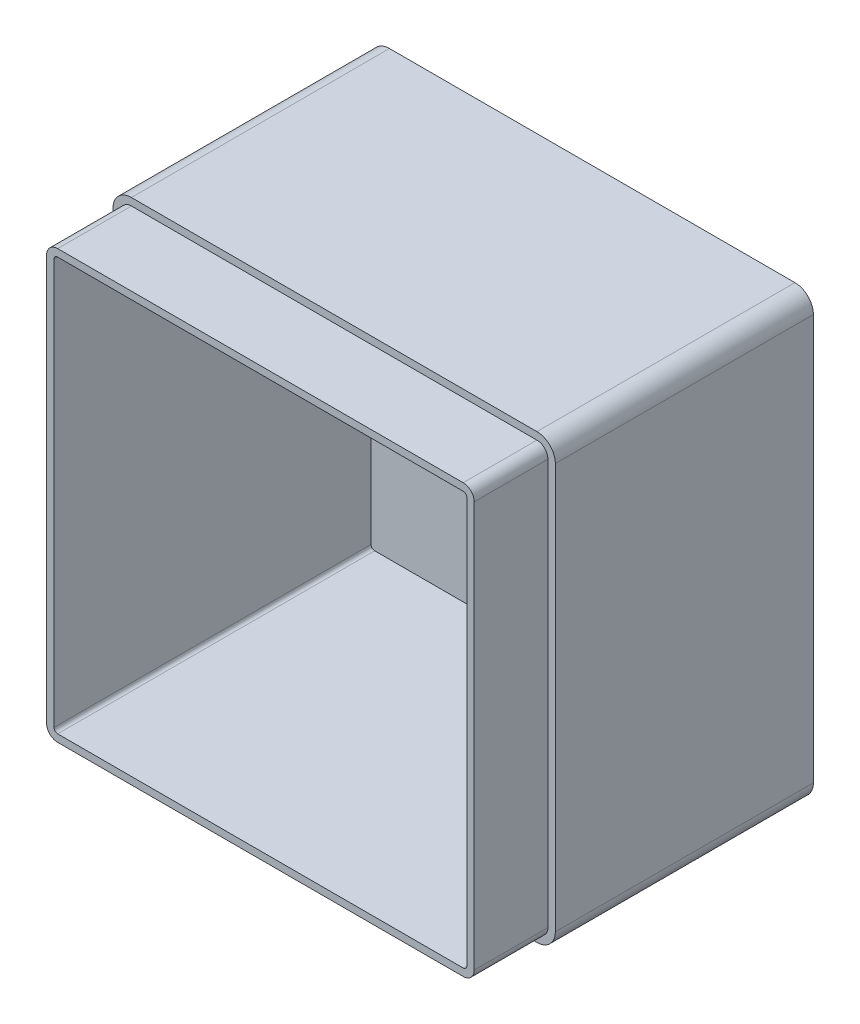
ISO-10303-21;
HEADER;
FILE_DESCRIPTION(('STEP AP214'),'2;1');
FILE_NAME('part.step','',(''),(''),'','','');
FILE_SCHEMA(('AUTOMOTIVE_DESIGN { 1 0 10303 214 1 1 1 1 }'));
ENDSEC;
DATA;
#1=APPLICATION_CONTEXT('core data for automotive mechanical design processes');
#2=APPLICATION_PROTOCOL_DEFINITION('international standard','automotive_design',2000,#1);
#3=PRODUCT_CONTEXT('',#1,'mechanical');
#4=PRODUCT('Part','Part','',(#3));
#5=PRODUCT_RELATED_PRODUCT_CATEGORY('part','',(#4));
#6=PRODUCT_DEFINITION_FORMATION('','',#4);
#7=PRODUCT_DEFINITION_CONTEXT('part definition',#1,'design');
#8=PRODUCT_DEFINITION('design','',#6,#7);
#9=PRODUCT_DEFINITION_SHAPE('','',#8);
#10=(LENGTH_UNIT() NAMED_UNIT(*) SI_UNIT(.MILLI.,.METRE.));
#11=(NAMED_UNIT(*) PLANE_ANGLE_UNIT() SI_UNIT($,.RADIAN.));
#12=(NAMED_UNIT(*) SI_UNIT($,.STERADIAN.) SOLID_ANGLE_UNIT());
#13=UNCERTAINTY_MEASURE_WITH_UNIT(LENGTH_MEASURE(1.E-05),#10,'distance_accuracy_value','');
#14=(GEOMETRIC_REPRESENTATION_CONTEXT(3) GLOBAL_UNCERTAINTY_ASSIGNED_CONTEXT((#13)) GLOBAL_UNIT_ASSIGNED_CONTEXT((#10,
#11,#12)) REPRESENTATION_CONTEXT('',''));
#15=CARTESIAN_POINT('',(0.,0.,0.));
#16=DIRECTION('',(0.,0.,1.));
#17=DIRECTION('',(1.,0.,0.));
#18=AXIS2_PLACEMENT_3D('',#15,#16,#17);
#19=CARTESIAN_POINT('',(0.,0.,90.));
#20=DIRECTION('',(0.,0.,1.));
#21=DIRECTION('',(1.,0.,0.));
#22=AXIS2_PLACEMENT_3D('',#19,#20,#21);
#23=PLANE('',#22);
#24=DIRECTION('',(0.,-1.,0.));
#25=VECTOR('',#24,1.);
#26=CARTESIAN_POINT('',(4.,0.,90.));
#27=LINE('',#26,#25);
#28=CARTESIAN_POINT('',(4.,-4.99999999999999,90.));
#29=VERTEX_POINT('',#28);
#30=CARTESIAN_POINT('',(4.,-115.,90.));
#31=VERTEX_POINT('',#30);
#32=EDGE_CURVE('E349',#29,#31,#27,.T.);
#33=ORIENTED_EDGE('',*,*,#32,.F.);
#34=CARTESIAN_POINT('',(5.,-5.,90.));
#35=DIRECTION('',(0.,0.,1.));
#36=DIRECTION('',(1.,0.,0.));
#37=AXIS2_PLACEMENT_3D('',#34,#35,#36);
#38=CIRCLE('',#37,1.);
#39=CARTESIAN_POINT('',(5.,-4.,90.));
#40=VERTEX_POINT('',#39);
#41=EDGE_CURVE('E389',#40,#29,#38,.T.);
#42=ORIENTED_EDGE('',*,*,#41,.F.);
#43=DIRECTION('',(-1.,0.,0.));
#44=VECTOR('',#43,1.);
#45=CARTESIAN_POINT('',(0.,-4.,90.));
#46=LINE('',#45,#44);
#47=CARTESIAN_POINT('',(115.,-4.,90.));
#48=VERTEX_POINT('',#47);
#49=EDGE_CURVE('E365',#48,#40,#46,.T.);
#50=ORIENTED_EDGE('',*,*,#49,.F.);
#51=CARTESIAN_POINT('',(115.,-5.,90.));
#52=DIRECTION('',(0.,0.,1.));
#53=DIRECTION('',(1.,0.,0.));
#54=AXIS2_PLACEMENT_3D('',#51,#52,#53);
#55=CIRCLE('',#54,1.);
#56=CARTESIAN_POINT('',(116.,-5.,90.));
#57=VERTEX_POINT('',#56);
#58=EDGE_CURVE('E396',#57,#48,#55,.T.);
#59=ORIENTED_EDGE('',*,*,#58,.F.);
#60=DIRECTION('',(0.,1.,0.));
#61=VECTOR('',#60,1.);
#62=CARTESIAN_POINT('',(116.,0.,90.));
#63=LINE('',#62,#61);
#64=CARTESIAN_POINT('',(116.,-115.,90.));
#65=VERTEX_POINT('',#64);
#66=EDGE_CURVE('E393',#65,#57,#63,.T.);
#67=ORIENTED_EDGE('',*,*,#66,.F.);
#68=CARTESIAN_POINT('',(115.,-115.,90.));
#69=DIRECTION('',(0.,0.,1.));
#70=DIRECTION('',(1.,0.,0.));
#71=AXIS2_PLACEMENT_3D('',#68,#69,#70);
#72=CIRCLE('',#71,1.);
#73=CARTESIAN_POINT('',(115.,-116.,90.));
#74=VERTEX_POINT('',#73);
#75=EDGE_CURVE('E329',#74,#65,#72,.T.);
#76=ORIENTED_EDGE('',*,*,#75,.F.);
#77=DIRECTION('',(1.,0.,0.));
#78=VECTOR('',#77,1.);
#79=CARTESIAN_POINT('',(0.,-116.,90.));
#80=LINE('',#79,#78);
#81=CARTESIAN_POINT('',(5.,-116.,90.));
#82=VERTEX_POINT('',#81);
#83=EDGE_CURVE('E386',#82,#74,#80,.T.);
#84=ORIENTED_EDGE('',*,*,#83,.F.);
#85=CARTESIAN_POINT('',(5.,-115.,90.));
#86=DIRECTION('',(0.,0.,1.));
#87=DIRECTION('',(1.,0.,0.));
#88=AXIS2_PLACEMENT_3D('',#85,#86,#87);
#89=CIRCLE('',#88,1.);
#90=EDGE_CURVE('E379',#31,#82,#89,.T.);
#91=ORIENTED_EDGE('',*,*,#90,.F.);
#92=EDGE_LOOP('',(#33,#42,#50,#59,#67,#76,#84,#91));
#93=FACE_BOUND('',#92,.T.);
#94=DIRECTION('',(-1.,0.,0.));
#95=VECTOR('',#94,1.);
#96=CARTESIAN_POINT('',(115.,-2.,90.));
#97=LINE('',#96,#95);
#98=CARTESIAN_POINT('',(115.,-1.99999999999997,90.));
#99=VERTEX_POINT('',#98);
#100=CARTESIAN_POINT('',(5.,-2.00000000000002,90.));
#101=VERTEX_POINT('',#100);
#102=EDGE_CURVE('E230',#99,#101,#97,.T.);
#103=ORIENTED_EDGE('',*,*,#102,.T.);
#104=CARTESIAN_POINT('',(5.,-5.,90.));
#105=DIRECTION('',(0.,0.,1.));
#106=DIRECTION('',(1.,0.,0.));
#107=AXIS2_PLACEMENT_3D('',#104,#105,#106);
#108=CIRCLE('',#107,2.99999999999999);
#109=CARTESIAN_POINT('',(2.,-5.,90.));
#110=VERTEX_POINT('',#109);
#111=EDGE_CURVE('E257',#101,#110,#108,.T.);
#112=ORIENTED_EDGE('',*,*,#111,.T.);
#113=DIRECTION('',(0.,-1.,0.));
#114=VECTOR('',#113,1.);
#115=CARTESIAN_POINT('',(2.,-5.,90.));
#116=LINE('',#115,#114);
#117=CARTESIAN_POINT('',(2.00000000000001,-115.,90.));
#118=VERTEX_POINT('',#117);
#119=EDGE_CURVE('E207',#110,#118,#116,.T.);
#120=ORIENTED_EDGE('',*,*,#119,.T.);
#121=CARTESIAN_POINT('',(5.,-115.,90.));
#122=DIRECTION('',(0.,0.,1.));
#123=DIRECTION('',(1.,0.,0.));
#124=AXIS2_PLACEMENT_3D('',#121,#122,#123);
#125=CIRCLE('',#124,2.99999999999999);
#126=CARTESIAN_POINT('',(5.,-118.,90.));
#127=VERTEX_POINT('',#126);
#128=EDGE_CURVE('E55',#118,#127,#125,.T.);
#129=ORIENTED_EDGE('',*,*,#128,.T.);
#130=DIRECTION('',(1.,0.,0.));
#131=VECTOR('',#130,1.);
#132=CARTESIAN_POINT('',(5.,-118.,90.));
#133=LINE('',#132,#131);
#134=CARTESIAN_POINT('',(115.,-118.,90.));
#135=VERTEX_POINT('',#134);
#136=EDGE_CURVE('E264',#127,#135,#133,.T.);
#137=ORIENTED_EDGE('',*,*,#136,.T.);
#138=CARTESIAN_POINT('',(115.,-115.,90.));
#139=DIRECTION('',(0.,0.,1.));
#140=DIRECTION('',(1.,0.,0.));
#141=AXIS2_PLACEMENT_3D('',#138,#139,#140);
#142=CIRCLE('',#141,3.);
#143=CARTESIAN_POINT('',(118.,-115.,90.));
#144=VERTEX_POINT('',#143);
#145=EDGE_CURVE('E268',#135,#144,#142,.T.);
#146=ORIENTED_EDGE('',*,*,#145,.T.);
#147=DIRECTION('',(0.,1.,0.));
#148=VECTOR('',#147,1.);
#149=CARTESIAN_POINT('',(118.,-115.,90.));
#150=LINE('',#149,#148);
#151=CARTESIAN_POINT('',(118.,-4.99999999999999,90.));
#152=VERTEX_POINT('',#151);
#153=EDGE_CURVE('E272',#144,#152,#150,.T.);
#154=ORIENTED_EDGE('',*,*,#153,.T.);
#155=CARTESIAN_POINT('',(115.,-5.,90.));
#156=DIRECTION('',(0.,0.,1.));
#157=DIRECTION('',(1.,0.,0.));
#158=AXIS2_PLACEMENT_3D('',#155,#156,#157);
#159=CIRCLE('',#158,3.00000000000003);
#160=EDGE_CURVE('E234',#152,#99,#159,.T.);
#161=ORIENTED_EDGE('',*,*,#160,.T.);
#162=EDGE_LOOP('',(#103,#112,#120,#129,#137,#146,#154,#161));
#163=FACE_BOUND('',#162,.T.);
#164=ADVANCED_FACE('F39',(#93,#163),#23,.T.);
#165=CARTESIAN_POINT('',(4.,0.,90.));
#166=DIRECTION('',(1.,0.,0.));
#167=DIRECTION('',(0.,0.,-1.));
#168=AXIS2_PLACEMENT_3D('',#165,#166,#167);
#169=PLANE('',#168);
#170=DIRECTION('',(0.,-1.,0.));
#171=VECTOR('',#170,1.);
#172=CARTESIAN_POINT('',(4.,0.,4.));
#173=LINE('',#172,#171);
#174=CARTESIAN_POINT('',(4.,-4.99999999999999,4.));
#175=VERTEX_POINT('',#174);
#176=CARTESIAN_POINT('',(4.,-115.,4.));
#177=VERTEX_POINT('',#176);
#178=EDGE_CURVE('E321',#175,#177,#173,.T.);
#179=ORIENTED_EDGE('',*,*,#178,.F.);
#180=DIRECTION('',(0.,0.,-1.));
#181=VECTOR('',#180,1.);
#182=CARTESIAN_POINT('',(4.,-4.99999999999999,90.));
#183=LINE('',#182,#181);
#184=EDGE_CURVE('E330',#29,#175,#183,.T.);
#185=ORIENTED_EDGE('',*,*,#184,.F.);
#186=ORIENTED_EDGE('',*,*,#32,.T.);
#187=DIRECTION('',(0.,0.,-1.));
#188=VECTOR('',#187,1.);
#189=CARTESIAN_POINT('',(4.,-115.,90.));
#190=LINE('',#189,#188);
#191=EDGE_CURVE('E326',#177,#31,#190,.F.);
#192=ORIENTED_EDGE('',*,*,#191,.F.);
#193=EDGE_LOOP('',(#179,#185,#186,#192));
#194=FACE_BOUND('',#193,.T.);
#195=ADVANCED_FACE('F503',(#194),#169,.T.);
#196=CARTESIAN_POINT('',(0.,-116.,90.));
#197=DIRECTION('',(0.,1.,0.));
#198=DIRECTION('',(0.,0.,1.));
#199=AXIS2_PLACEMENT_3D('',#196,#197,#198);
#200=PLANE('',#199);
#201=ORIENTED_EDGE('',*,*,#83,.T.);
#202=DIRECTION('',(0.,0.,1.));
#203=VECTOR('',#202,1.);
#204=CARTESIAN_POINT('',(115.,-116.,90.));
#205=LINE('',#204,#203);
#206=CARTESIAN_POINT('',(115.,-116.,4.));
#207=VERTEX_POINT('',#206);
#208=EDGE_CURVE('E362',#207,#74,#205,.T.);
#209=ORIENTED_EDGE('',*,*,#208,.F.);
#210=DIRECTION('',(1.,0.,0.));
#211=VECTOR('',#210,1.);
#212=CARTESIAN_POINT('',(0.,-116.,4.));
#213=LINE('',#212,#211);
#214=CARTESIAN_POINT('',(5.,-116.,4.));
#215=VERTEX_POINT('',#214);
#216=EDGE_CURVE('E325',#215,#207,#213,.T.);
#217=ORIENTED_EDGE('',*,*,#216,.F.);
#218=DIRECTION('',(0.,0.,1.));
#219=VECTOR('',#218,1.);
#220=CARTESIAN_POINT('',(5.,-116.,90.));
#221=LINE('',#220,#219);
#222=EDGE_CURVE('E358',#82,#215,#221,.F.);
#223=ORIENTED_EDGE('',*,*,#222,.F.);
#224=EDGE_LOOP('',(#201,#209,#217,#223));
#225=FACE_BOUND('',#224,.T.);
#226=ADVANCED_FACE('F509',(#225),#200,.T.);
#227=CARTESIAN_POINT('',(116.,0.,90.));
#228=DIRECTION('',(-1.,0.,0.));
#229=DIRECTION('',(0.,-1.,0.));
#230=AXIS2_PLACEMENT_3D('',#227,#228,#229);
#231=PLANE('',#230);
#232=DIRECTION('',(0.,1.,0.));
#233=VECTOR('',#232,1.);
#234=CARTESIAN_POINT('',(116.,0.,4.));
#235=LINE('',#234,#233);
#236=CARTESIAN_POINT('',(116.,-115.,4.));
#237=VERTEX_POINT('',#236);
#238=CARTESIAN_POINT('',(116.,-5.,4.));
#239=VERTEX_POINT('',#238);
#240=EDGE_CURVE('E338',#237,#239,#235,.T.);
#241=ORIENTED_EDGE('',*,*,#240,.F.);
#242=DIRECTION('',(0.,0.,1.));
#243=VECTOR('',#242,1.);
#244=CARTESIAN_POINT('',(116.,-115.,90.));
#245=LINE('',#244,#243);
#246=EDGE_CURVE('E366',#65,#237,#245,.F.);
#247=ORIENTED_EDGE('',*,*,#246,.F.);
#248=ORIENTED_EDGE('',*,*,#66,.T.);
#249=DIRECTION('',(0.,0.,1.));
#250=VECTOR('',#249,1.);
#251=CARTESIAN_POINT('',(116.,-5.,90.));
#252=LINE('',#251,#250);
#253=EDGE_CURVE('E370',#239,#57,#252,.T.);
#254=ORIENTED_EDGE('',*,*,#253,.F.);
#255=EDGE_LOOP('',(#241,#247,#248,#254));
#256=FACE_BOUND('',#255,.T.);
#257=ADVANCED_FACE('F656',(#256),#231,.T.);
#258=CARTESIAN_POINT('',(0.,-4.,90.));
#259=DIRECTION('',(0.,-1.,0.));
#260=DIRECTION('',(0.,0.,-1.));
#261=AXIS2_PLACEMENT_3D('',#258,#259,#260);
#262=PLANE('',#261);
#263=DIRECTION('',(-1.,0.,0.));
#264=VECTOR('',#263,1.);
#265=CARTESIAN_POINT('',(0.,-4.,4.));
#266=LINE('',#265,#264);
#267=CARTESIAN_POINT('',(115.,-4.,4.));
#268=VERTEX_POINT('',#267);
#269=CARTESIAN_POINT('',(5.,-4.,4.));
#270=VERTEX_POINT('',#269);
#271=EDGE_CURVE('E345',#268,#270,#266,.T.);
#272=ORIENTED_EDGE('',*,*,#271,.F.);
#273=DIRECTION('',(0.,0.,-1.));
#274=VECTOR('',#273,1.);
#275=CARTESIAN_POINT('',(115.,-4.,90.));
#276=LINE('',#275,#274);
#277=EDGE_CURVE('E375',#48,#268,#276,.T.);
#278=ORIENTED_EDGE('',*,*,#277,.F.);
#279=ORIENTED_EDGE('',*,*,#49,.T.);
#280=DIRECTION('',(0.,0.,-1.));
#281=VECTOR('',#280,1.);
#282=CARTESIAN_POINT('',(5.,-4.,90.));
#283=LINE('',#282,#281);
#284=EDGE_CURVE('E371',#270,#40,#283,.F.);
#285=ORIENTED_EDGE('',*,*,#284,.F.);
#286=EDGE_LOOP('',(#272,#278,#279,#285));
#287=FACE_BOUND('',#286,.T.);
#288=ADVANCED_FACE('F648',(#287),#262,.T.);
#289=CARTESIAN_POINT('',(0.,0.,4.));
#290=DIRECTION('',(0.,0.,1.));
#291=DIRECTION('',(1.,0.,0.));
#292=AXIS2_PLACEMENT_3D('',#289,#290,#291);
#293=PLANE('',#292);
#294=ORIENTED_EDGE('',*,*,#216,.T.);
#295=CARTESIAN_POINT('',(115.,-115.,4.));
#296=DIRECTION('',(0.,0.,1.));
#297=DIRECTION('',(1.,0.,0.));
#298=AXIS2_PLACEMENT_3D('',#295,#296,#297);
#299=CIRCLE('',#298,1.);
#300=EDGE_CURVE('E352',#237,#207,#299,.F.);
#301=ORIENTED_EDGE('',*,*,#300,.F.);
#302=ORIENTED_EDGE('',*,*,#240,.T.);
#303=CARTESIAN_POINT('',(115.,-5.,4.));
#304=DIRECTION('',(0.,0.,1.));
#305=DIRECTION('',(1.,0.,0.));
#306=AXIS2_PLACEMENT_3D('',#303,#304,#305);
#307=CIRCLE('',#306,1.);
#308=EDGE_CURVE('E344',#268,#239,#307,.F.);
#309=ORIENTED_EDGE('',*,*,#308,.F.);
#310=ORIENTED_EDGE('',*,*,#271,.T.);
#311=CARTESIAN_POINT('',(5.,-5.,4.));
#312=DIRECTION('',(0.,0.,1.));
#313=DIRECTION('',(1.,0.,0.));
#314=AXIS2_PLACEMENT_3D('',#311,#312,#313);
#315=CIRCLE('',#314,1.);
#316=EDGE_CURVE('E341',#175,#270,#315,.F.);
#317=ORIENTED_EDGE('',*,*,#316,.F.);
#318=ORIENTED_EDGE('',*,*,#178,.T.);
#319=CARTESIAN_POINT('',(5.,-115.,4.));
#320=DIRECTION('',(0.,0.,1.));
#321=DIRECTION('',(1.,0.,0.));
#322=AXIS2_PLACEMENT_3D('',#319,#320,#321);
#323=CIRCLE('',#322,1.);
#324=EDGE_CURVE('E334',#215,#177,#323,.F.);
#325=ORIENTED_EDGE('',*,*,#324,.F.);
#326=EDGE_LOOP('',(#294,#301,#302,#309,#310,#317,#318,#325));
#327=FACE_BOUND('',#326,.T.);
#328=ADVANCED_FACE('F640',(#327),#293,.T.);
#329=CARTESIAN_POINT('',(5.,-115.,90.));
#330=DIRECTION('',(0.,0.,-1.));
#331=DIRECTION('',(-1.,0.,0.));
#332=AXIS2_PLACEMENT_3D('',#329,#330,#331);
#333=CYLINDRICAL_SURFACE('',#332,1.);
#334=ORIENTED_EDGE('',*,*,#90,.T.);
#335=ORIENTED_EDGE('',*,*,#222,.T.);
#336=ORIENTED_EDGE('',*,*,#324,.T.);
#337=ORIENTED_EDGE('',*,*,#191,.T.);
#338=EDGE_LOOP('',(#334,#335,#336,#337));
#339=FACE_BOUND('',#338,.T.);
#340=ADVANCED_FACE('F632',(#339),#333,.F.);
#341=CARTESIAN_POINT('',(5.,-5.,90.));
#342=DIRECTION('',(0.,0.,-1.));
#343=DIRECTION('',(-1.,0.,0.));
#344=AXIS2_PLACEMENT_3D('',#341,#342,#343);
#345=CYLINDRICAL_SURFACE('',#344,1.);
#346=ORIENTED_EDGE('',*,*,#41,.T.);
#347=ORIENTED_EDGE('',*,*,#184,.T.);
#348=ORIENTED_EDGE('',*,*,#316,.T.);
#349=ORIENTED_EDGE('',*,*,#284,.T.);
#350=EDGE_LOOP('',(#346,#347,#348,#349));
#351=FACE_BOUND('',#350,.T.);
#352=ADVANCED_FACE('F625',(#351),#345,.F.);
#353=CARTESIAN_POINT('',(115.,-5.,90.));
#354=DIRECTION('',(0.,0.,-1.));
#355=DIRECTION('',(-1.,0.,0.));
#356=AXIS2_PLACEMENT_3D('',#353,#354,#355);
#357=CYLINDRICAL_SURFACE('',#356,1.);
#358=ORIENTED_EDGE('',*,*,#58,.T.);
#359=ORIENTED_EDGE('',*,*,#277,.T.);
#360=ORIENTED_EDGE('',*,*,#308,.T.);
#361=ORIENTED_EDGE('',*,*,#253,.T.);
#362=EDGE_LOOP('',(#358,#359,#360,#361));
#363=FACE_BOUND('',#362,.T.);
#364=ADVANCED_FACE('F618',(#363),#357,.F.);
#365=CARTESIAN_POINT('',(115.,-115.,90.));
#366=DIRECTION('',(0.,0.,-1.));
#367=DIRECTION('',(-1.,0.,0.));
#368=AXIS2_PLACEMENT_3D('',#365,#366,#367);
#369=CYLINDRICAL_SURFACE('',#368,1.);
#370=ORIENTED_EDGE('',*,*,#75,.T.);
#371=ORIENTED_EDGE('',*,*,#246,.T.);
#372=ORIENTED_EDGE('',*,*,#300,.T.);
#373=ORIENTED_EDGE('',*,*,#208,.T.);
#374=EDGE_LOOP('',(#370,#371,#372,#373));
#375=FACE_BOUND('',#374,.T.);
#376=ADVANCED_FACE('F516',(#375),#369,.F.);
#377=CARTESIAN_POINT('',(5.,-5.,70.));
#378=DIRECTION('',(0.,0.,1.));
#379=DIRECTION('',(1.,0.,0.));
#380=AXIS2_PLACEMENT_3D('',#377,#378,#379);
#381=PLANE('',#380);
#382=DIRECTION('',(-1.,0.,0.));
#383=VECTOR('',#382,1.);
#384=CARTESIAN_POINT('',(115.,-2.,70.));
#385=LINE('',#384,#383);
#386=CARTESIAN_POINT('',(115.,-1.99999999999997,70.));
#387=VERTEX_POINT('',#386);
#388=CARTESIAN_POINT('',(5.,-2.00000000000002,70.));
#389=VERTEX_POINT('',#388);
#390=EDGE_CURVE('E214',#387,#389,#385,.T.);
#391=ORIENTED_EDGE('',*,*,#390,.F.);
#392=CARTESIAN_POINT('',(115.,-5.,70.));
#393=DIRECTION('',(0.,0.,1.));
#394=DIRECTION('',(1.,0.,0.));
#395=AXIS2_PLACEMENT_3D('',#392,#393,#394);
#396=CIRCLE('',#395,3.00000000000003);
#397=CARTESIAN_POINT('',(118.,-4.99999999999999,70.));
#398=VERTEX_POINT('',#397);
#399=EDGE_CURVE('E251',#398,#387,#396,.T.);
#400=ORIENTED_EDGE('',*,*,#399,.F.);
#401=DIRECTION('',(0.,1.,0.));
#402=VECTOR('',#401,1.);
#403=CARTESIAN_POINT('',(118.,-115.,70.));
#404=LINE('',#403,#402);
#405=CARTESIAN_POINT('',(118.,-115.,70.));
#406=VERTEX_POINT('',#405);
#407=EDGE_CURVE('E247',#406,#398,#404,.T.);
#408=ORIENTED_EDGE('',*,*,#407,.F.);
#409=CARTESIAN_POINT('',(115.,-115.,70.));
#410=DIRECTION('',(0.,0.,1.));
#411=DIRECTION('',(1.,0.,0.));
#412=AXIS2_PLACEMENT_3D('',#409,#410,#411);
#413=CIRCLE('',#412,3.);
#414=CARTESIAN_POINT('',(115.,-118.,70.));
#415=VERTEX_POINT('',#414);
#416=EDGE_CURVE('E243',#415,#406,#413,.T.);
#417=ORIENTED_EDGE('',*,*,#416,.F.);
#418=DIRECTION('',(1.,0.,0.));
#419=VECTOR('',#418,1.);
#420=CARTESIAN_POINT('',(5.,-118.,70.));
#421=LINE('',#420,#419);
#422=CARTESIAN_POINT('',(5.,-118.,70.));
#423=VERTEX_POINT('',#422);
#424=EDGE_CURVE('E239',#423,#415,#421,.T.);
#425=ORIENTED_EDGE('',*,*,#424,.F.);
#426=CARTESIAN_POINT('',(5.,-115.,70.));
#427=DIRECTION('',(0.,0.,1.));
#428=DIRECTION('',(1.,0.,0.));
#429=AXIS2_PLACEMENT_3D('',#426,#427,#428);
#430=CIRCLE('',#429,2.99999999999999);
#431=CARTESIAN_POINT('',(2.00000000000001,-115.,70.));
#432=VERTEX_POINT('',#431);
#433=EDGE_CURVE('E224',#432,#423,#430,.T.);
#434=ORIENTED_EDGE('',*,*,#433,.F.);
#435=DIRECTION('',(0.,-1.,0.));
#436=VECTOR('',#435,1.);
#437=CARTESIAN_POINT('',(2.,-5.,70.));
#438=LINE('',#437,#436);
#439=CARTESIAN_POINT('',(2.,-5.,70.));
#440=VERTEX_POINT('',#439);
#441=EDGE_CURVE('E205',#440,#432,#438,.T.);
#442=ORIENTED_EDGE('',*,*,#441,.F.);
#443=CARTESIAN_POINT('',(5.,-5.,70.));
#444=DIRECTION('',(0.,0.,1.));
#445=DIRECTION('',(1.,0.,0.));
#446=AXIS2_PLACEMENT_3D('',#443,#444,#445);
#447=CIRCLE('',#446,2.99999999999999);
#448=EDGE_CURVE('E220',#389,#440,#447,.T.);
#449=ORIENTED_EDGE('',*,*,#448,.F.);
#450=EDGE_LOOP('',(#391,#400,#408,#417,#425,#434,#442,#449));
#451=FACE_BOUND('',#450,.T.);
#452=CARTESIAN_POINT('',(5.,-5.,70.));
#453=DIRECTION('',(0.,0.,1.));
#454=DIRECTION('',(1.,0.,0.));
#455=AXIS2_PLACEMENT_3D('',#452,#453,#454);
#456=CIRCLE('',#455,5.);
#457=CARTESIAN_POINT('',(5.,0.,70.));
#458=VERTEX_POINT('',#457);
#459=CARTESIAN_POINT('',(0.,-5.,70.));
#460=VERTEX_POINT('',#459);
#461=EDGE_CURVE('E281',#458,#460,#456,.T.);
#462=ORIENTED_EDGE('',*,*,#461,.T.);
#463=DIRECTION('',(0.,-1.,0.));
#464=VECTOR('',#463,1.);
#465=CARTESIAN_POINT('',(0.,-5.,70.));
#466=LINE('',#465,#464);
#467=CARTESIAN_POINT('',(0.,-115.,70.));
#468=VERTEX_POINT('',#467);
#469=EDGE_CURVE('E301',#460,#468,#466,.T.);
#470=ORIENTED_EDGE('',*,*,#469,.T.);
#471=CARTESIAN_POINT('',(5.,-115.,70.));
#472=DIRECTION('',(0.,0.,1.));
#473=DIRECTION('',(1.,0.,0.));
#474=AXIS2_PLACEMENT_3D('',#471,#472,#473);
#475=CIRCLE('',#474,5.);
#476=CARTESIAN_POINT('',(5.,-120.,70.));
#477=VERTEX_POINT('',#476);
#478=EDGE_CURVE('E304',#468,#477,#475,.T.);
#479=ORIENTED_EDGE('',*,*,#478,.T.);
#480=DIRECTION('',(1.,0.,0.));
#481=VECTOR('',#480,1.);
#482=CARTESIAN_POINT('',(5.,-120.,70.));
#483=LINE('',#482,#481);
#484=CARTESIAN_POINT('',(115.,-120.,70.));
#485=VERTEX_POINT('',#484);
#486=EDGE_CURVE('E63',#477,#485,#483,.T.);
#487=ORIENTED_EDGE('',*,*,#486,.T.);
#488=CARTESIAN_POINT('',(115.,-115.,70.));
#489=DIRECTION('',(0.,0.,1.));
#490=DIRECTION('',(1.,0.,0.));
#491=AXIS2_PLACEMENT_3D('',#488,#489,#490);
#492=CIRCLE('',#491,5.);
#493=CARTESIAN_POINT('',(120.,-115.,70.));
#494=VERTEX_POINT('',#493);
#495=EDGE_CURVE('E309',#485,#494,#492,.T.);
#496=ORIENTED_EDGE('',*,*,#495,.T.);
#497=DIRECTION('',(0.,1.,0.));
#498=VECTOR('',#497,1.);
#499=CARTESIAN_POINT('',(120.,-115.,70.));
#500=LINE('',#499,#498);
#501=CARTESIAN_POINT('',(120.,-4.99999999999999,70.));
#502=VERTEX_POINT('',#501);
#503=EDGE_CURVE('E312',#494,#502,#500,.T.);
#504=ORIENTED_EDGE('',*,*,#503,.T.);
#505=CARTESIAN_POINT('',(115.,-5.,70.));
#506=DIRECTION('',(0.,0.,1.));
#507=DIRECTION('',(1.,0.,0.));
#508=AXIS2_PLACEMENT_3D('',#505,#506,#507);
#509=CIRCLE('',#508,5.);
#510=CARTESIAN_POINT('',(115.,0.,70.));
#511=VERTEX_POINT('',#510);
#512=EDGE_CURVE('E315',#502,#511,#509,.T.);
#513=ORIENTED_EDGE('',*,*,#512,.T.);
#514=DIRECTION('',(-1.,0.,0.));
#515=VECTOR('',#514,1.);
#516=CARTESIAN_POINT('',(115.,0.,70.));
#517=LINE('',#516,#515);
#518=EDGE_CURVE('E318',#511,#458,#517,.T.);
#519=ORIENTED_EDGE('',*,*,#518,.T.);
#520=EDGE_LOOP('',(#462,#470,#479,#487,#496,#504,#513,#519));
#521=FACE_BOUND('',#520,.T.);
#522=ADVANCED_FACE('F219',(#451,#521),#381,.T.);
#523=CARTESIAN_POINT('',(5.,-5.,70.));
#524=DIRECTION('',(0.,0.,1.));
#525=DIRECTION('',(1.,0.,0.));
#526=AXIS2_PLACEMENT_3D('',#523,#524,#525);
#527=CYLINDRICAL_SURFACE('',#526,2.99999999999999);
#528=ORIENTED_EDGE('',*,*,#111,.F.);
#529=DIRECTION('',(0.,0.,1.));
#530=VECTOR('',#529,1.);
#531=CARTESIAN_POINT('',(5.,-2.00000000000002,70.));
#532=LINE('',#531,#530);
#533=EDGE_CURVE('E228',#389,#101,#532,.T.);
#534=ORIENTED_EDGE('',*,*,#533,.F.);
#535=ORIENTED_EDGE('',*,*,#448,.T.);
#536=DIRECTION('',(0.,0.,1.));
#537=VECTOR('',#536,1.);
#538=CARTESIAN_POINT('',(2.,-5.,70.));
#539=LINE('',#538,#537);
#540=EDGE_CURVE('E202',#440,#110,#539,.T.);
#541=ORIENTED_EDGE('',*,*,#540,.T.);
#542=EDGE_LOOP('',(#528,#534,#535,#541));
#543=FACE_BOUND('',#542,.T.);
#544=ADVANCED_FACE('F227',(#543),#527,.T.);
#545=CARTESIAN_POINT('',(115.,-2.,70.));
#546=DIRECTION('',(0.,1.,0.));
#547=DIRECTION('',(-1.,0.,0.));
#548=AXIS2_PLACEMENT_3D('',#545,#546,#547);
#549=PLANE('',#548);
#550=ORIENTED_EDGE('',*,*,#102,.F.);
#551=DIRECTION('',(0.,0.,1.));
#552=VECTOR('',#551,1.);
#553=CARTESIAN_POINT('',(115.,-1.99999999999997,70.));
#554=LINE('',#553,#552);
#555=EDGE_CURVE('E282',#387,#99,#554,.T.);
#556=ORIENTED_EDGE('',*,*,#555,.F.);
#557=ORIENTED_EDGE('',*,*,#390,.T.);
#558=ORIENTED_EDGE('',*,*,#533,.T.);
#559=EDGE_LOOP('',(#550,#556,#557,#558));
#560=FACE_BOUND('',#559,.T.);
#561=ADVANCED_FACE('F591',(#560),#549,.T.);
#562=CARTESIAN_POINT('',(115.,-5.,70.));
#563=DIRECTION('',(0.,0.,1.));
#564=DIRECTION('',(1.,0.,0.));
#565=AXIS2_PLACEMENT_3D('',#562,#563,#564);
#566=CYLINDRICAL_SURFACE('',#565,3.00000000000003);
#567=ORIENTED_EDGE('',*,*,#160,.F.);
#568=DIRECTION('',(0.,0.,1.));
#569=VECTOR('',#568,1.);
#570=CARTESIAN_POINT('',(118.,-4.99999999999999,70.));
#571=LINE('',#570,#569);
#572=EDGE_CURVE('E285',#398,#152,#571,.T.);
#573=ORIENTED_EDGE('',*,*,#572,.F.);
#574=ORIENTED_EDGE('',*,*,#399,.T.);
#575=ORIENTED_EDGE('',*,*,#555,.T.);
#576=EDGE_LOOP('',(#567,#573,#574,#575));
#577=FACE_BOUND('',#576,.T.);
#578=ADVANCED_FACE('F583',(#577),#566,.T.);
#579=CARTESIAN_POINT('',(118.,-115.,70.));
#580=DIRECTION('',(1.,0.,0.));
#581=DIRECTION('',(0.,0.,-1.));
#582=AXIS2_PLACEMENT_3D('',#579,#580,#581);
#583=PLANE('',#582);
#584=ORIENTED_EDGE('',*,*,#153,.F.);
#585=DIRECTION('',(0.,0.,1.));
#586=VECTOR('',#585,1.);
#587=CARTESIAN_POINT('',(118.,-115.,70.));
#588=LINE('',#587,#586);
#589=EDGE_CURVE('E288',#406,#144,#588,.T.);
#590=ORIENTED_EDGE('',*,*,#589,.F.);
#591=ORIENTED_EDGE('',*,*,#407,.T.);
#592=ORIENTED_EDGE('',*,*,#572,.T.);
#593=EDGE_LOOP('',(#584,#590,#591,#592));
#594=FACE_BOUND('',#593,.T.);
#595=ADVANCED_FACE('F575',(#594),#583,.T.);
#596=CARTESIAN_POINT('',(115.,-115.,70.));
#597=DIRECTION('',(0.,0.,1.));
#598=DIRECTION('',(1.,0.,0.));
#599=AXIS2_PLACEMENT_3D('',#596,#597,#598);
#600=CYLINDRICAL_SURFACE('',#599,3.);
#601=ORIENTED_EDGE('',*,*,#145,.F.);
#602=DIRECTION('',(0.,0.,1.));
#603=VECTOR('',#602,1.);
#604=CARTESIAN_POINT('',(115.,-118.,70.));
#605=LINE('',#604,#603);
#606=EDGE_CURVE('E291',#415,#135,#605,.T.);
#607=ORIENTED_EDGE('',*,*,#606,.F.);
#608=ORIENTED_EDGE('',*,*,#416,.T.);
#609=ORIENTED_EDGE('',*,*,#589,.T.);
#610=EDGE_LOOP('',(#601,#607,#608,#609));
#611=FACE_BOUND('',#610,.T.);
#612=ADVANCED_FACE('F567',(#611),#600,.T.);
#613=CARTESIAN_POINT('',(5.,-118.,70.));
#614=DIRECTION('',(0.,-1.,0.));
#615=DIRECTION('',(0.,0.,-1.));
#616=AXIS2_PLACEMENT_3D('',#613,#614,#615);
#617=PLANE('',#616);
#618=ORIENTED_EDGE('',*,*,#136,.F.);
#619=DIRECTION('',(0.,0.,1.));
#620=VECTOR('',#619,1.);
#621=CARTESIAN_POINT('',(5.,-118.,70.));
#622=LINE('',#621,#620);
#623=EDGE_CURVE('E294',#423,#127,#622,.T.);
#624=ORIENTED_EDGE('',*,*,#623,.F.);
#625=ORIENTED_EDGE('',*,*,#424,.T.);
#626=ORIENTED_EDGE('',*,*,#606,.T.);
#627=EDGE_LOOP('',(#618,#624,#625,#626));
#628=FACE_BOUND('',#627,.T.);
#629=ADVANCED_FACE('F560',(#628),#617,.T.);
#630=CARTESIAN_POINT('',(5.,-115.,70.));
#631=DIRECTION('',(0.,0.,1.));
#632=DIRECTION('',(1.,0.,0.));
#633=AXIS2_PLACEMENT_3D('',#630,#631,#632);
#634=CYLINDRICAL_SURFACE('',#633,2.99999999999999);
#635=ORIENTED_EDGE('',*,*,#128,.F.);
#636=DIRECTION('',(0.,0.,1.));
#637=VECTOR('',#636,1.);
#638=CARTESIAN_POINT('',(2.00000000000001,-115.,70.));
#639=LINE('',#638,#637);
#640=EDGE_CURVE('E213',#432,#118,#639,.T.);
#641=ORIENTED_EDGE('',*,*,#640,.F.);
#642=ORIENTED_EDGE('',*,*,#433,.T.);
#643=ORIENTED_EDGE('',*,*,#623,.T.);
#644=EDGE_LOOP('',(#635,#641,#642,#643));
#645=FACE_BOUND('',#644,.T.);
#646=ADVANCED_FACE('F553',(#645),#634,.T.);
#647=CARTESIAN_POINT('',(2.,-5.,70.));
#648=DIRECTION('',(-1.,0.,0.));
#649=DIRECTION('',(0.,-1.,0.));
#650=AXIS2_PLACEMENT_3D('',#647,#648,#649);
#651=PLANE('',#650);
#652=ORIENTED_EDGE('',*,*,#119,.F.);
#653=ORIENTED_EDGE('',*,*,#540,.F.);
#654=ORIENTED_EDGE('',*,*,#441,.T.);
#655=ORIENTED_EDGE('',*,*,#640,.T.);
#656=EDGE_LOOP('',(#652,#653,#654,#655));
#657=FACE_BOUND('',#656,.T.);
#658=ADVANCED_FACE('F204',(#657),#651,.T.);
#659=CARTESIAN_POINT('',(0.,0.,0.));
#660=DIRECTION('',(0.,0.,1.));
#661=DIRECTION('',(1.,0.,0.));
#662=AXIS2_PLACEMENT_3D('',#659,#660,#661);
#663=PLANE('',#662);
#664=DIRECTION('',(1.,0.,0.));
#665=VECTOR('',#664,1.);
#666=CARTESIAN_POINT('',(0.,-120.,0.));
#667=LINE('',#666,#665);
#668=CARTESIAN_POINT('',(5.,-120.,0.));
#669=VERTEX_POINT('',#668);
#670=CARTESIAN_POINT('',(115.,-120.,0.));
#671=VERTEX_POINT('',#670);
#672=EDGE_CURVE('E409',#669,#671,#667,.T.);
#673=ORIENTED_EDGE('',*,*,#672,.F.);
#674=CARTESIAN_POINT('',(5.,-115.,0.));
#675=DIRECTION('',(0.,0.,1.));
#676=DIRECTION('',(1.,0.,0.));
#677=AXIS2_PLACEMENT_3D('',#674,#675,#676);
#678=CIRCLE('',#677,5.);
#679=CARTESIAN_POINT('',(0.,-115.,0.));
#680=VERTEX_POINT('',#679);
#681=EDGE_CURVE('E437',#669,#680,#678,.F.);
#682=ORIENTED_EDGE('',*,*,#681,.T.);
#683=DIRECTION('',(0.,-1.,0.));
#684=VECTOR('',#683,1.);
#685=CARTESIAN_POINT('',(0.,0.,0.));
#686=LINE('',#685,#684);
#687=CARTESIAN_POINT('',(0.,-5.,0.));
#688=VERTEX_POINT('',#687);
#689=EDGE_CURVE('E374',#688,#680,#686,.T.);
#690=ORIENTED_EDGE('',*,*,#689,.F.);
#691=CARTESIAN_POINT('',(5.,-5.,0.));
#692=DIRECTION('',(0.,0.,1.));
#693=DIRECTION('',(1.,0.,0.));
#694=AXIS2_PLACEMENT_3D('',#691,#692,#693);
#695=CIRCLE('',#694,5.);
#696=CARTESIAN_POINT('',(5.,0.,0.));
#697=VERTEX_POINT('',#696);
#698=EDGE_CURVE('E434',#688,#697,#695,.F.);
#699=ORIENTED_EDGE('',*,*,#698,.T.);
#700=DIRECTION('',(-1.,0.,0.));
#701=VECTOR('',#700,1.);
#702=CARTESIAN_POINT('',(0.,0.,0.));
#703=LINE('',#702,#701);
#704=CARTESIAN_POINT('',(115.,0.,0.));
#705=VERTEX_POINT('',#704);
#706=EDGE_CURVE('E417',#705,#697,#703,.T.);
#707=ORIENTED_EDGE('',*,*,#706,.F.);
#708=CARTESIAN_POINT('',(115.,-5.,0.));
#709=DIRECTION('',(0.,0.,1.));
#710=DIRECTION('',(1.,0.,0.));
#711=AXIS2_PLACEMENT_3D('',#708,#709,#710);
#712=CIRCLE('',#711,5.);
#713=CARTESIAN_POINT('',(120.,-4.99999999999999,0.));
#714=VERTEX_POINT('',#713);
#715=EDGE_CURVE('E431',#705,#714,#712,.F.);
#716=ORIENTED_EDGE('',*,*,#715,.T.);
#717=DIRECTION('',(0.,1.,0.));
#718=VECTOR('',#717,1.);
#719=CARTESIAN_POINT('',(120.,0.,0.));
#720=LINE('',#719,#718);
#721=CARTESIAN_POINT('',(120.,-115.,0.));
#722=VERTEX_POINT('',#721);
#723=EDGE_CURVE('E413',#722,#714,#720,.T.);
#724=ORIENTED_EDGE('',*,*,#723,.F.);
#725=CARTESIAN_POINT('',(115.,-115.,0.));
#726=DIRECTION('',(0.,0.,1.));
#727=DIRECTION('',(1.,0.,0.));
#728=AXIS2_PLACEMENT_3D('',#725,#726,#727);
#729=CIRCLE('',#728,5.);
#730=EDGE_CURVE('E428',#722,#671,#729,.F.);
#731=ORIENTED_EDGE('',*,*,#730,.T.);
#732=EDGE_LOOP('',(#673,#682,#690,#699,#707,#716,#724,#731));
#733=FACE_BOUND('',#732,.T.);
#734=ADVANCED_FACE('F465',(#733),#663,.F.);
#735=CARTESIAN_POINT('',(5.,-5.,90.));
#736=DIRECTION('',(0.,0.,-1.));
#737=DIRECTION('',(-1.,0.,0.));
#738=AXIS2_PLACEMENT_3D('',#735,#736,#737);
#739=CYLINDRICAL_SURFACE('',#738,5.);
#740=DIRECTION('',(0.,0.,-1.));
#741=VECTOR('',#740,1.);
#742=CARTESIAN_POINT('',(0.,-5.,90.));
#743=LINE('',#742,#741);
#744=EDGE_CURVE('E440',#460,#688,#743,.T.);
#745=ORIENTED_EDGE('',*,*,#744,.F.);
#746=ORIENTED_EDGE('',*,*,#461,.F.);
#747=DIRECTION('',(0.,0.,-1.));
#748=VECTOR('',#747,1.);
#749=CARTESIAN_POINT('',(5.,0.,90.));
#750=LINE('',#749,#748);
#751=EDGE_CURVE('E450',#697,#458,#750,.F.);
#752=ORIENTED_EDGE('',*,*,#751,.F.);
#753=ORIENTED_EDGE('',*,*,#698,.F.);
#754=EDGE_LOOP('',(#745,#746,#752,#753));
#755=FACE_BOUND('',#754,.T.);
#756=ADVANCED_FACE('F480',(#755),#739,.T.);
#757=CARTESIAN_POINT('',(115.,-5.,90.));
#758=DIRECTION('',(0.,0.,-1.));
#759=DIRECTION('',(-1.,0.,0.));
#760=AXIS2_PLACEMENT_3D('',#757,#758,#759);
#761=CYLINDRICAL_SURFACE('',#760,5.);
#762=DIRECTION('',(0.,0.,-1.));
#763=VECTOR('',#762,1.);
#764=CARTESIAN_POINT('',(115.,0.,90.));
#765=LINE('',#764,#763);
#766=EDGE_CURVE('E447',#511,#705,#765,.T.);
#767=ORIENTED_EDGE('',*,*,#766,.F.);
#768=ORIENTED_EDGE('',*,*,#512,.F.);
#769=DIRECTION('',(0.,0.,-1.));
#770=VECTOR('',#769,1.);
#771=CARTESIAN_POINT('',(120.,-5.,90.));
#772=LINE('',#771,#770);
#773=EDGE_CURVE('E11',#714,#502,#772,.F.);
#774=ORIENTED_EDGE('',*,*,#773,.F.);
#775=ORIENTED_EDGE('',*,*,#715,.F.);
#776=EDGE_LOOP('',(#767,#768,#774,#775));
#777=FACE_BOUND('',#776,.T.);
#778=ADVANCED_FACE('F470',(#777),#761,.T.);
#779=CARTESIAN_POINT('',(0.,0.,90.));
#780=DIRECTION('',(0.,-1.,0.));
#781=DIRECTION('',(0.,0.,-1.));
#782=AXIS2_PLACEMENT_3D('',#779,#780,#781);
#783=PLANE('',#782);
#784=ORIENTED_EDGE('',*,*,#518,.F.);
#785=ORIENTED_EDGE('',*,*,#766,.T.);
#786=ORIENTED_EDGE('',*,*,#706,.T.);
#787=ORIENTED_EDGE('',*,*,#751,.T.);
#788=EDGE_LOOP('',(#784,#785,#786,#787));
#789=FACE_BOUND('',#788,.T.);
#790=ADVANCED_FACE('F475',(#789),#783,.F.);
#791=CARTESIAN_POINT('',(115.,-115.,90.));
#792=DIRECTION('',(0.,0.,-1.));
#793=DIRECTION('',(-1.,0.,0.));
#794=AXIS2_PLACEMENT_3D('',#791,#792,#793);
#795=CYLINDRICAL_SURFACE('',#794,5.);
#796=DIRECTION('',(0.,0.,-1.));
#797=VECTOR('',#796,1.);
#798=CARTESIAN_POINT('',(120.,-115.,90.));
#799=LINE('',#798,#797);
#800=EDGE_CURVE('E48',#494,#722,#799,.T.);
#801=ORIENTED_EDGE('',*,*,#800,.F.);
#802=ORIENTED_EDGE('',*,*,#495,.F.);
#803=DIRECTION('',(0.,0.,-1.));
#804=VECTOR('',#803,1.);
#805=CARTESIAN_POINT('',(115.,-120.,90.));
#806=LINE('',#805,#804);
#807=EDGE_CURVE('E421',#671,#485,#806,.F.);
#808=ORIENTED_EDGE('',*,*,#807,.F.);
#809=ORIENTED_EDGE('',*,*,#730,.F.);
#810=EDGE_LOOP('',(#801,#802,#808,#809));
#811=FACE_BOUND('',#810,.T.);
#812=ADVANCED_FACE('F41',(#811),#795,.T.);
#813=CARTESIAN_POINT('',(120.,0.,90.));
#814=DIRECTION('',(-1.,0.,0.));
#815=DIRECTION('',(0.,-1.,0.));
#816=AXIS2_PLACEMENT_3D('',#813,#814,#815);
#817=PLANE('',#816);
#818=ORIENTED_EDGE('',*,*,#503,.F.);
#819=ORIENTED_EDGE('',*,*,#800,.T.);
#820=ORIENTED_EDGE('',*,*,#723,.T.);
#821=ORIENTED_EDGE('',*,*,#773,.T.);
#822=EDGE_LOOP('',(#818,#819,#820,#821));
#823=FACE_BOUND('',#822,.T.);
#824=ADVANCED_FACE('F458',(#823),#817,.F.);
#825=CARTESIAN_POINT('',(5.,-115.,90.));
#826=DIRECTION('',(0.,0.,-1.));
#827=DIRECTION('',(-1.,0.,0.));
#828=AXIS2_PLACEMENT_3D('',#825,#826,#827);
#829=CYLINDRICAL_SURFACE('',#828,5.);
#830=DIRECTION('',(0.,0.,-1.));
#831=VECTOR('',#830,1.);
#832=CARTESIAN_POINT('',(5.,-120.,90.));
#833=LINE('',#832,#831);
#834=EDGE_CURVE('E425',#477,#669,#833,.T.);
#835=ORIENTED_EDGE('',*,*,#834,.F.);
#836=ORIENTED_EDGE('',*,*,#478,.F.);
#837=DIRECTION('',(0.,0.,-1.));
#838=VECTOR('',#837,1.);
#839=CARTESIAN_POINT('',(0.,-115.,90.));
#840=LINE('',#839,#838);
#841=EDGE_CURVE('E443',#680,#468,#840,.F.);
#842=ORIENTED_EDGE('',*,*,#841,.F.);
#843=ORIENTED_EDGE('',*,*,#681,.F.);
#844=EDGE_LOOP('',(#835,#836,#842,#843));
#845=FACE_BOUND('',#844,.T.);
#846=ADVANCED_FACE('F490',(#845),#829,.T.);
#847=CARTESIAN_POINT('',(0.,-120.,90.));
#848=DIRECTION('',(0.,1.,0.));
#849=DIRECTION('',(0.,0.,1.));
#850=AXIS2_PLACEMENT_3D('',#847,#848,#849);
#851=PLANE('',#850);
#852=ORIENTED_EDGE('',*,*,#486,.F.);
#853=ORIENTED_EDGE('',*,*,#834,.T.);
#854=ORIENTED_EDGE('',*,*,#672,.T.);
#855=ORIENTED_EDGE('',*,*,#807,.T.);
#856=EDGE_LOOP('',(#852,#853,#854,#855));
#857=FACE_BOUND('',#856,.T.);
#858=ADVANCED_FACE('F492',(#857),#851,.F.);
#859=CARTESIAN_POINT('',(0.,0.,90.));
#860=DIRECTION('',(1.,0.,0.));
#861=DIRECTION('',(0.,0.,-1.));
#862=AXIS2_PLACEMENT_3D('',#859,#860,#861);
#863=PLANE('',#862);
#864=ORIENTED_EDGE('',*,*,#469,.F.);
#865=ORIENTED_EDGE('',*,*,#744,.T.);
#866=ORIENTED_EDGE('',*,*,#689,.T.);
#867=ORIENTED_EDGE('',*,*,#841,.T.);
#868=EDGE_LOOP('',(#864,#865,#866,#867));
#869=FACE_BOUND('',#868,.T.);
#870=ADVANCED_FACE('F485',(#869),#863,.F.);
#871=CLOSED_SHELL('',(#164,#195,#226,#257,#288,#328,#340,#352,#364,#376,#522,#544,#561,#578,
#595,#612,#629,#646,#658,#734,#756,#778,#790,#812,#824,#846,#858,#870));
#872=MANIFOLD_SOLID_BREP('B2',#871);
#873=ADVANCED_BREP_SHAPE_REPRESENTATION('',(#18,#872),#14);
#874=SHAPE_DEFINITION_REPRESENTATION(#9,#873);
ENDSEC;
END-ISO-10303-21;
